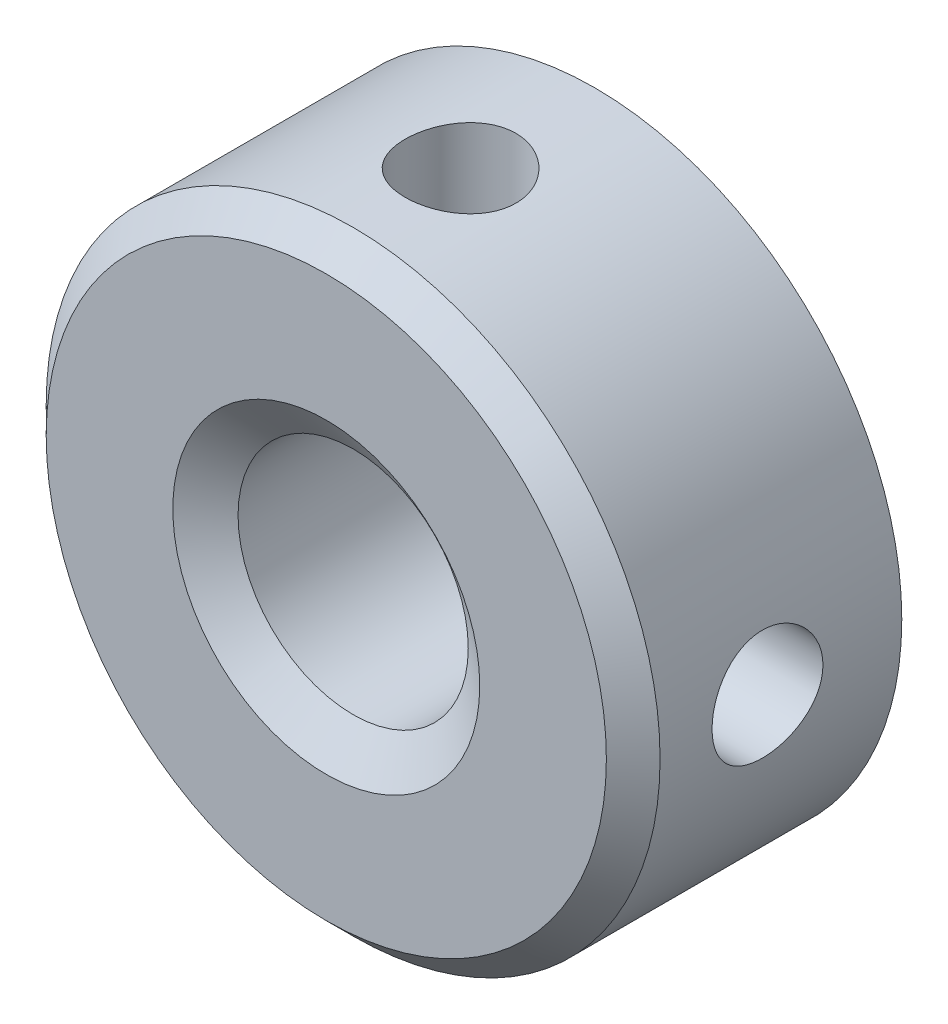
ISO-10303-21;
HEADER;
FILE_DESCRIPTION(('STEP AP214'),'2;1');
FILE_NAME('part.step','',(''),(''),'','','');
FILE_SCHEMA(('AUTOMOTIVE_DESIGN { 1 0 10303 214 1 1 1 1 }'));
ENDSEC;
DATA;
#1=APPLICATION_CONTEXT('core data for automotive mechanical design processes');
#2=APPLICATION_PROTOCOL_DEFINITION('international standard','automotive_design',2000,#1);
#3=PRODUCT_CONTEXT('',#1,'mechanical');
#4=PRODUCT('Part','Part','',(#3));
#5=PRODUCT_RELATED_PRODUCT_CATEGORY('part','',(#4));
#6=PRODUCT_DEFINITION_FORMATION('','',#4);
#7=PRODUCT_DEFINITION_CONTEXT('part definition',#1,'design');
#8=PRODUCT_DEFINITION('design','',#6,#7);
#9=PRODUCT_DEFINITION_SHAPE('','',#8);
#10=(LENGTH_UNIT() NAMED_UNIT(*) SI_UNIT(.MILLI.,.METRE.));
#11=(NAMED_UNIT(*) PLANE_ANGLE_UNIT() SI_UNIT($,.RADIAN.));
#12=(NAMED_UNIT(*) SI_UNIT($,.STERADIAN.) SOLID_ANGLE_UNIT());
#13=UNCERTAINTY_MEASURE_WITH_UNIT(LENGTH_MEASURE(1.E-05),#10,'distance_accuracy_value','');
#14=(GEOMETRIC_REPRESENTATION_CONTEXT(3) GLOBAL_UNCERTAINTY_ASSIGNED_CONTEXT((#13)) GLOBAL_UNIT_ASSIGNED_CONTEXT((#10,
#11,#12)) REPRESENTATION_CONTEXT('',''));
#15=CARTESIAN_POINT('',(0.,0.,0.));
#16=DIRECTION('',(0.,0.,1.));
#17=DIRECTION('',(1.,0.,0.));
#18=AXIS2_PLACEMENT_3D('',#15,#16,#17);
#19=CARTESIAN_POINT('',(0.,0.,-3.5));
#20=DIRECTION('',(0.,0.,1.));
#21=DIRECTION('',(1.,0.,0.));
#22=AXIS2_PLACEMENT_3D('',#19,#20,#21);
#23=CYLINDRICAL_SURFACE('',#22,4.);
#24=CARTESIAN_POINT('',(0.,-4.,-1.0275));
#25=CARTESIAN_POINT('',(0.0402324055650416,-3.99999928207121,-1.02750156488479));
#26=CARTESIAN_POINT('',(0.0804854857145578,-3.99938672130152,-1.03087186677428));
#27=CARTESIAN_POINT('',(0.159859162671895,-3.99700211722237,-1.04425640081981));
#28=CARTESIAN_POINT('',(0.19897874343806,-3.99522906532468,-1.05427641237524));
#29=CARTESIAN_POINT('',(0.27492586707515,-3.99072200016209,-1.08064504702147));
#30=CARTESIAN_POINT('',(0.311755380953226,-3.98798882711238,-1.09698813796246));
#31=CARTESIAN_POINT('',(0.382145759809329,-3.9818606825439,-1.1355237134609));
#32=CARTESIAN_POINT('',(0.415706926094003,-3.97846577211701,-1.15771565811625));
#33=CARTESIAN_POINT('',(0.47898600302115,-3.97134709947296,-1.20758186073378));
#34=CARTESIAN_POINT('',(0.508662190652253,-3.96762039202556,-1.23530864933891));
#35=CARTESIAN_POINT('',(0.562968147654841,-3.96028023924715,-1.29534444782425));
#36=CARTESIAN_POINT('',(0.587597570135685,-3.95666680171624,-1.32765377242808));
#37=CARTESIAN_POINT('',(0.631282247393574,-3.94993373469824,-1.39622956474506));
#38=CARTESIAN_POINT('',(0.650295461943718,-3.94681790591371,-1.43252321915994));
#39=CARTESIAN_POINT('',(0.681938983056788,-3.94147413899126,-1.50785513757615));
#40=CARTESIAN_POINT('',(0.694569798778226,-3.93924613003013,-1.54689318235948));
#41=CARTESIAN_POINT('',(0.712956902250887,-3.93595980867137,-1.62616067510412));
#42=CARTESIAN_POINT('',(0.718785710518137,-3.93488916609034,-1.66637277984826));
#43=CARTESIAN_POINT('',(0.723628356024185,-3.93400158582586,-1.7472173787824));
#44=CARTESIAN_POINT('',(0.722642759986563,-3.93418454388604,-1.78784983773279));
#45=CARTESIAN_POINT('',(0.713943469606807,-3.93577225569209,-1.8678589979259));
#46=CARTESIAN_POINT('',(0.706311894985369,-3.93716209623533,-1.90724496736938));
#47=CARTESIAN_POINT('',(0.684666451097885,-3.94098357666604,-1.9841681657055));
#48=CARTESIAN_POINT('',(0.670652328407126,-3.94341525792047,-2.02170532112377));
#49=CARTESIAN_POINT('',(0.636558283861672,-3.94906219895749,-2.09410752900945));
#50=CARTESIAN_POINT('',(0.616444881836429,-3.95228176427296,-2.12895646608407));
#51=CARTESIAN_POINT('',(0.570746933286653,-3.95913881579743,-2.19481570761747));
#52=CARTESIAN_POINT('',(0.545161870270259,-3.96277634144435,-2.22582564926161));
#53=CARTESIAN_POINT('',(0.488802508987584,-3.97012462715362,-2.28360141563335));
#54=CARTESIAN_POINT('',(0.457957894942576,-3.97383568101403,-2.31029865845852));
#55=CARTESIAN_POINT('',(0.392191146362397,-3.98086397441441,-2.3581497176235));
#56=CARTESIAN_POINT('',(0.357268976336028,-3.98418121052606,-2.37930348570752));
#57=CARTESIAN_POINT('',(0.284269308760035,-3.99005408991156,-2.41547588942557));
#58=CARTESIAN_POINT('',(0.246188387537775,-3.99260889265116,-2.43048776072078));
#59=CARTESIAN_POINT('',(0.167989096769151,-3.99666247663319,-2.45388285857468));
#60=CARTESIAN_POINT('',(0.127870928261586,-3.99816136185897,-2.46226673784658));
#61=CARTESIAN_POINT('',(0.0473263508697057,-3.99992004723597,-2.47207325851328));
#62=CARTESIAN_POINT('',(0.00691174350009734,-4.0001965830578,-2.47358992865411));
#63=CARTESIAN_POINT('',(-0.0735937397235727,-3.99952550657702,-2.46987067399199));
#64=CARTESIAN_POINT('',(-0.113684630210687,-3.99857794992261,-2.46463505615339));
#65=CARTESIAN_POINT('',(-0.192109072794261,-3.99557555589605,-2.44763803762266));
#66=CARTESIAN_POINT('',(-0.230453194126716,-3.99352873504343,-2.43592386440099));
#67=CARTESIAN_POINT('',(-0.304633286138314,-3.98855635966055,-2.40635310354291));
#68=CARTESIAN_POINT('',(-0.340469096087984,-3.98563074888197,-2.38849612271589));
#69=CARTESIAN_POINT('',(-0.409019064929369,-3.97918360232313,-2.34693605402778));
#70=CARTESIAN_POINT('',(-0.441697568686679,-3.97565628053125,-2.32317507147534));
#71=CARTESIAN_POINT('',(-0.502637121291057,-3.96841270168175,-2.27056026824363));
#72=CARTESIAN_POINT('',(-0.530897788908464,-3.96469642835552,-2.24170600850561));
#73=CARTESIAN_POINT('',(-0.582553768946835,-3.95743874926351,-2.1792993480324));
#74=CARTESIAN_POINT('',(-0.605885124668485,-3.95390004881302,-2.14569364228149));
#75=CARTESIAN_POINT('',(-0.646571553083887,-3.94745124522646,-2.07498469815049));
#76=CARTESIAN_POINT('',(-0.66392683756291,-3.94454111981576,-2.03788158377403));
#77=CARTESIAN_POINT('',(-0.69207607502021,-3.93969987677514,-1.96139903738241));
#78=CARTESIAN_POINT('',(-0.702900202744308,-3.93776426376046,-1.92203100881771));
#79=CARTESIAN_POINT('',(-0.717773626282637,-3.9350805763172,-1.84199715558159));
#80=CARTESIAN_POINT('',(-0.721823625489806,-3.93433237859352,-1.80133146609995));
#81=CARTESIAN_POINT('',(-0.723011621106424,-3.93411417186203,-1.72049656217886));
#82=CARTESIAN_POINT('',(-0.720250422703558,-3.93462552149006,-1.68032884461655));
#83=CARTESIAN_POINT('',(-0.708114167671675,-3.93682762266059,-1.60103996601868));
#84=CARTESIAN_POINT('',(-0.698739143983392,-3.93851836832901,-1.56191879977167));
#85=CARTESIAN_POINT('',(-0.673682577896795,-3.94288116614926,-1.48588254841445));
#86=CARTESIAN_POINT('',(-0.658011189155687,-3.94555163777399,-1.44896402084413));
#87=CARTESIAN_POINT('',(-0.620817521589325,-3.9515742400628,-1.37826400544472));
#88=CARTESIAN_POINT('',(-0.599294870915518,-3.95492641404576,-1.34448271717077));
#89=CARTESIAN_POINT('',(-0.550655967041241,-3.96199300823466,-1.28050963824912));
#90=CARTESIAN_POINT('',(-0.523466068712371,-3.96571181881409,-1.25037431605228));
#91=CARTESIAN_POINT('',(-0.464418731346957,-3.97305909493448,-1.19506007581957));
#92=CARTESIAN_POINT('',(-0.432560220563081,-3.97668753950624,-1.16988229897852));
#93=CARTESIAN_POINT('',(-0.364765210846601,-3.98348031155494,-1.12500472965806));
#94=CARTESIAN_POINT('',(-0.328797180021505,-3.98664055471551,-1.1053519385649));
#95=CARTESIAN_POINT('',(-0.254025487566143,-3.992101059684,-1.07239893856745));
#96=CARTESIAN_POINT('',(-0.215224586226555,-3.99440214561284,-1.0590926385635));
#97=CARTESIAN_POINT('',(-0.146913775912392,-3.99740453445352,-1.04197641876778));
#98=CARTESIAN_POINT('',(-0.117808246455036,-3.99837243932543,-1.03655683634259));
#99=CARTESIAN_POINT('',(-0.0591388618449127,-3.99967042883236,-1.02931809210109));
#100=CARTESIAN_POINT('',(-0.0295750169721853,-4.00000052775259,-1.02749884964636));
#101=CARTESIAN_POINT('',(0.,-4.,-1.0275));
#102=B_SPLINE_CURVE_WITH_KNOTS('',3,(#24,#25,#26,#27,#28,#29,#30,#31,#32,#33,#34,#35,#36,#37,
#38,#39,#40,#41,#42,#43,#44,#45,#46,#47,#48,#49,#50,#51,#52,#53,#54,#55,#56,#57,#58,#59,#60,#61,
#62,#63,#64,#65,#66,#67,#68,#69,#70,#71,#72,#73,#74,#75,#76,#77,#78,#79,#80,#81,#82,#83,#84,#85,
#86,#87,#88,#89,#90,#91,#92,#93,#94,#95,#96,#97,#98,#99,#100,#101),.UNSPECIFIED.,.T.,.F.,(4,2,2,
2,2,2,2,2,2,2,2,2,2,2,2,2,2,2,2,2,2,2,2,2,2,2,2,2,2,2,2,2,2,2,2,2,2,2,4),(0.,0.120589077301182,
0.241283098546327,0.361871760845293,0.482449295616093,0.60423085178249,0.726020775828199,
0.848700511370488,0.971370458540291,1.09272023628634,1.21405992203462,1.33392123633206,
1.45378731024392,1.57432364379394,1.69487136027419,1.81717925404505,1.93948821246774,
2.06193151480696,2.1843627576384,2.30511244801172,2.42585664920233,2.54573203321307,
2.66561509167033,2.78672363080564,2.90784261503429,3.0304478177818,3.15304867509096,
3.27507867560439,3.39709600432244,3.51731835068335,3.6375400982706,3.75756874681702,
3.87760502498541,3.99931106772016,4.12104509372834,4.24378537426311,4.36640761551682,
4.45505515819371,4.54370071536978),.UNSPECIFIED.);
#103=CARTESIAN_POINT('',(0.,-4.,-1.0275));
#104=VERTEX_POINT('',#103);
#105=EDGE_CURVE('E45',#104,#104,#102,.T.);
#106=ORIENTED_EDGE('',*,*,#105,.T.);
#107=EDGE_LOOP('',(#106));
#108=FACE_BOUND('',#107,.T.);
#109=CARTESIAN_POINT('',(0.,4.,-1.0275));
#110=CARTESIAN_POINT('',(-0.0402324055650226,3.99999928207121,-1.02750156488479));
#111=CARTESIAN_POINT('',(-0.0804854857145388,3.99938672130152,-1.03087186677428));
#112=CARTESIAN_POINT('',(-0.159859162671876,3.99700211722237,-1.04425640081981));
#113=CARTESIAN_POINT('',(-0.198978743438041,3.99522906532468,-1.05427641237524));
#114=CARTESIAN_POINT('',(-0.274925867075131,3.99072200016209,-1.08064504702147));
#115=CARTESIAN_POINT('',(-0.311755380953207,3.98798882711238,-1.09698813796246));
#116=CARTESIAN_POINT('',(-0.38214575980931,3.9818606825439,-1.1355237134609));
#117=CARTESIAN_POINT('',(-0.415706926093984,3.97846577211701,-1.15771565811625));
#118=CARTESIAN_POINT('',(-0.478986003021131,3.97134709947296,-1.20758186073378));
#119=CARTESIAN_POINT('',(-0.508662190652234,3.96762039202556,-1.23530864933891));
#120=CARTESIAN_POINT('',(-0.562968147654822,3.96028023924716,-1.29534444782425));
#121=CARTESIAN_POINT('',(-0.587597570135666,3.95666680171624,-1.32765377242808));
#122=CARTESIAN_POINT('',(-0.631282247393555,3.94993373469824,-1.39622956474506));
#123=CARTESIAN_POINT('',(-0.650295461943699,3.94681790591372,-1.43252321915994));
#124=CARTESIAN_POINT('',(-0.681938983056769,3.94147413899126,-1.50785513757615));
#125=CARTESIAN_POINT('',(-0.694569798778208,3.93924613003014,-1.54689318235948));
#126=CARTESIAN_POINT('',(-0.712956902250869,3.93595980867138,-1.62616067510412));
#127=CARTESIAN_POINT('',(-0.718785710518118,3.93488916609034,-1.66637277984826));
#128=CARTESIAN_POINT('',(-0.723628356024166,3.93400158582587,-1.7472173787824));
#129=CARTESIAN_POINT('',(-0.722642759986545,3.93418454388605,-1.78784983773279));
#130=CARTESIAN_POINT('',(-0.713943469606788,3.93577225569209,-1.8678589979259));
#131=CARTESIAN_POINT('',(-0.70631189498535,3.93716209623534,-1.90724496736938));
#132=CARTESIAN_POINT('',(-0.684666451097866,3.94098357666604,-1.9841681657055));
#133=CARTESIAN_POINT('',(-0.670652328407107,3.94341525792047,-2.02170532112377));
#134=CARTESIAN_POINT('',(-0.636558283861653,3.94906219895749,-2.09410752900945));
#135=CARTESIAN_POINT('',(-0.61644488183641,3.95228176427296,-2.12895646608407));
#136=CARTESIAN_POINT('',(-0.570746933286634,3.95913881579743,-2.19481570761748));
#137=CARTESIAN_POINT('',(-0.54516187027024,3.96277634144435,-2.22582564926161));
#138=CARTESIAN_POINT('',(-0.488802508987565,3.97012462715362,-2.28360141563335));
#139=CARTESIAN_POINT('',(-0.457957894942557,3.97383568101403,-2.31029865845852));
#140=CARTESIAN_POINT('',(-0.392191146362378,3.98086397441441,-2.3581497176235));
#141=CARTESIAN_POINT('',(-0.357268976336009,3.98418121052607,-2.37930348570752));
#142=CARTESIAN_POINT('',(-0.284269308760015,3.99005408991156,-2.41547588942557));
#143=CARTESIAN_POINT('',(-0.246188387537755,3.99260889265116,-2.43048776072078));
#144=CARTESIAN_POINT('',(-0.167989096769131,3.9966624766332,-2.45388285857468));
#145=CARTESIAN_POINT('',(-0.127870928261567,3.99816136185897,-2.46226673784658));
#146=CARTESIAN_POINT('',(-0.0473263508696865,3.99992004723597,-2.47207325851328));
#147=CARTESIAN_POINT('',(-0.0069117435000781,4.0001965830578,-2.47358992865411));
#148=CARTESIAN_POINT('',(0.073593739723592,3.99952550657702,-2.46987067399199));
#149=CARTESIAN_POINT('',(0.113684630210707,3.99857794992261,-2.46463505615339));
#150=CARTESIAN_POINT('',(0.19210907279428,3.99557555589605,-2.44763803762266));
#151=CARTESIAN_POINT('',(0.230453194126735,3.99352873504343,-2.43592386440099));
#152=CARTESIAN_POINT('',(0.304633286138333,3.98855635966055,-2.40635310354291));
#153=CARTESIAN_POINT('',(0.340469096088003,3.98563074888197,-2.38849612271589));
#154=CARTESIAN_POINT('',(0.409019064929388,3.97918360232313,-2.34693605402778));
#155=CARTESIAN_POINT('',(0.441697568686698,3.97565628053125,-2.32317507147534));
#156=CARTESIAN_POINT('',(0.502637121291076,3.96841270168175,-2.27056026824363));
#157=CARTESIAN_POINT('',(0.530897788908483,3.96469642835551,-2.24170600850561));
#158=CARTESIAN_POINT('',(0.582553768946854,3.95743874926351,-2.1792993480324));
#159=CARTESIAN_POINT('',(0.605885124668504,3.95390004881302,-2.14569364228149));
#160=CARTESIAN_POINT('',(0.646571553083906,3.94745124522646,-2.07498469815049));
#161=CARTESIAN_POINT('',(0.663926837562929,3.94454111981575,-2.03788158377403));
#162=CARTESIAN_POINT('',(0.692076075020228,3.93969987677514,-1.96139903738241));
#163=CARTESIAN_POINT('',(0.702900202744327,3.93776426376046,-1.92203100881771));
#164=CARTESIAN_POINT('',(0.717773626282656,3.93508057631719,-1.84199715558159));
#165=CARTESIAN_POINT('',(0.721823625489825,3.93433237859352,-1.80133146609995));
#166=CARTESIAN_POINT('',(0.723011621106443,3.93411417186202,-1.72049656217886));
#167=CARTESIAN_POINT('',(0.720250422703577,3.93462552149006,-1.68032884461655));
#168=CARTESIAN_POINT('',(0.708114167671694,3.93682762266059,-1.60103996601868));
#169=CARTESIAN_POINT('',(0.698739143983411,3.938518368329,-1.56191879977167));
#170=CARTESIAN_POINT('',(0.673682577896814,3.94288116614926,-1.48588254841445));
#171=CARTESIAN_POINT('',(0.658011189155706,3.94555163777398,-1.44896402084413));
#172=CARTESIAN_POINT('',(0.620817521589343,3.9515742400628,-1.37826400544472));
#173=CARTESIAN_POINT('',(0.599294870915536,3.95492641404576,-1.34448271717077));
#174=CARTESIAN_POINT('',(0.55065596704126,3.96199300823466,-1.28050963824912));
#175=CARTESIAN_POINT('',(0.52346606871239,3.96571181881409,-1.25037431605228));
#176=CARTESIAN_POINT('',(0.464418731346975,3.97305909493447,-1.19506007581957));
#177=CARTESIAN_POINT('',(0.4325602205631,3.97668753950624,-1.16988229897852));
#178=CARTESIAN_POINT('',(0.364765210846619,3.98348031155494,-1.12500472965806));
#179=CARTESIAN_POINT('',(0.328797180021524,3.98664055471551,-1.1053519385649));
#180=CARTESIAN_POINT('',(0.254025487566162,3.992101059684,-1.07239893856745));
#181=CARTESIAN_POINT('',(0.215224586226574,3.99440214561284,-1.0590926385635));
#182=CARTESIAN_POINT('',(0.146913775912411,3.99740453445352,-1.04197641876778));
#183=CARTESIAN_POINT('',(0.117808246455056,3.99837243932543,-1.03655683634259));
#184=CARTESIAN_POINT('',(0.0591388618449323,3.99967042883236,-1.02931809210109));
#185=CARTESIAN_POINT('',(0.0295750169722046,4.00000052775259,-1.02749884964636));
#186=CARTESIAN_POINT('',(0.,4.,-1.0275));
#187=B_SPLINE_CURVE_WITH_KNOTS('',3,(#109,#110,#111,#112,#113,#114,#115,#116,#117,#118,#119,
#120,#121,#122,#123,#124,#125,#126,#127,#128,#129,#130,#131,#132,#133,#134,#135,#136,#137,#138,
#139,#140,#141,#142,#143,#144,#145,#146,#147,#148,#149,#150,#151,#152,#153,#154,#155,#156,#157,
#158,#159,#160,#161,#162,#163,#164,#165,#166,#167,#168,#169,#170,#171,#172,#173,#174,#175,#176,
#177,#178,#179,#180,#181,#182,#183,#184,#185,#186),.UNSPECIFIED.,.T.,.F.,(4,2,2,2,2,2,2,2,2,2,2,
2,2,2,2,2,2,2,2,2,2,2,2,2,2,2,2,2,2,2,2,2,2,2,2,2,2,2,4),(0.,0.120589077301182,
0.241283098546327,0.361871760845293,0.482449295616093,0.60423085178249,0.726020775828199,
0.848700511370488,0.971370458540291,1.09272023628634,1.21405992203462,1.33392123633206,
1.45378731024392,1.57432364379394,1.69487136027419,1.81717925404505,1.93948821246774,
2.06193151480696,2.1843627576384,2.30511244801172,2.42585664920233,2.54573203321307,
2.66561509167033,2.78672363080564,2.90784261503429,3.0304478177818,3.15304867509096,
3.27507867560439,3.39709600432244,3.51731835068335,3.6375400982706,3.75756874681702,
3.87760502498541,3.99931106772016,4.12104509372834,4.24378537426311,4.36640761551682,
4.45505515819371,4.54370071536978),.UNSPECIFIED.);
#188=CARTESIAN_POINT('',(0.,4.,-1.0275));
#189=VERTEX_POINT('',#188);
#190=EDGE_CURVE('E91',#189,#189,#187,.T.);
#191=ORIENTED_EDGE('',*,*,#190,.T.);
#192=EDGE_LOOP('',(#191));
#193=FACE_BOUND('',#192,.T.);
#194=CARTESIAN_POINT('',(0.,0.,-0.350000000000001));
#195=DIRECTION('',(0.,0.,1.));
#196=DIRECTION('',(1.,0.,0.));
#197=AXIS2_PLACEMENT_3D('',#194,#195,#196);
#198=CIRCLE('',#197,4.);
#199=CARTESIAN_POINT('',(4.,0.,-0.350000000000001));
#200=VERTEX_POINT('',#199);
#201=EDGE_CURVE('E165',#200,#200,#198,.F.);
#202=ORIENTED_EDGE('',*,*,#201,.T.);
#203=EDGE_LOOP('',(#202));
#204=FACE_BOUND('',#203,.T.);
#205=CARTESIAN_POINT('',(0.,0.,-3.5));
#206=DIRECTION('',(0.,0.,1.));
#207=DIRECTION('',(1.,0.,0.));
#208=AXIS2_PLACEMENT_3D('',#205,#206,#207);
#209=CIRCLE('',#208,4.);
#210=CARTESIAN_POINT('',(4.,0.,-3.5));
#211=VERTEX_POINT('',#210);
#212=EDGE_CURVE('E145',#211,#211,#209,.T.);
#213=ORIENTED_EDGE('',*,*,#212,.T.);
#214=EDGE_LOOP('',(#213));
#215=FACE_BOUND('',#214,.T.);
#216=CARTESIAN_POINT('',(-4.,0.,-1.0275));
#217=CARTESIAN_POINT('',(-3.99999928207121,-0.0402324055650321,-1.02750156488479));
#218=CARTESIAN_POINT('',(-3.99938672130152,-0.0804854857145483,-1.03087186677428));
#219=CARTESIAN_POINT('',(-3.99700211722237,-0.159859162671885,-1.04425640081981));
#220=CARTESIAN_POINT('',(-3.99522906532468,-0.198978743438051,-1.05427641237524));
#221=CARTESIAN_POINT('',(-3.99072200016209,-0.27492586707514,-1.08064504702147));
#222=CARTESIAN_POINT('',(-3.98798882711238,-0.311755380953217,-1.09698813796246));
#223=CARTESIAN_POINT('',(-3.9818606825439,-0.382145759809319,-1.1355237134609));
#224=CARTESIAN_POINT('',(-3.97846577211701,-0.415706926093993,-1.15771565811625));
#225=CARTESIAN_POINT('',(-3.97134709947296,-0.47898600302114,-1.20758186073378));
#226=CARTESIAN_POINT('',(-3.96762039202556,-0.508662190652244,-1.23530864933891));
#227=CARTESIAN_POINT('',(-3.96028023924716,-0.562968147654831,-1.29534444782425));
#228=CARTESIAN_POINT('',(-3.95666680171624,-0.587597570135675,-1.32765377242808));
#229=CARTESIAN_POINT('',(-3.94993373469824,-0.631282247393565,-1.39622956474506));
#230=CARTESIAN_POINT('',(-3.94681790591372,-0.650295461943708,-1.43252321915994));
#231=CARTESIAN_POINT('',(-3.94147413899126,-0.681938983056778,-1.50785513757615));
#232=CARTESIAN_POINT('',(-3.93924613003014,-0.694569798778217,-1.54689318235948));
#233=CARTESIAN_POINT('',(-3.93595980867138,-0.712956902250878,-1.62616067510412));
#234=CARTESIAN_POINT('',(-3.93488916609034,-0.718785710518127,-1.66637277984826));
#235=CARTESIAN_POINT('',(-3.93400158582587,-0.723628356024176,-1.7472173787824));
#236=CARTESIAN_POINT('',(-3.93418454388605,-0.722642759986554,-1.78784983773279));
#237=CARTESIAN_POINT('',(-3.93577225569209,-0.713943469606798,-1.8678589979259));
#238=CARTESIAN_POINT('',(-3.93716209623534,-0.70631189498536,-1.90724496736938));
#239=CARTESIAN_POINT('',(-3.94098357666604,-0.684666451097876,-1.9841681657055));
#240=CARTESIAN_POINT('',(-3.94341525792047,-0.670652328407117,-2.02170532112377));
#241=CARTESIAN_POINT('',(-3.94906219895749,-0.636558283861663,-2.09410752900945));
#242=CARTESIAN_POINT('',(-3.95228176427296,-0.61644488183642,-2.12895646608407));
#243=CARTESIAN_POINT('',(-3.95913881579743,-0.570746933286644,-2.19481570761748));
#244=CARTESIAN_POINT('',(-3.96277634144435,-0.54516187027025,-2.22582564926161));
#245=CARTESIAN_POINT('',(-3.97012462715362,-0.488802508987574,-2.28360141563335));
#246=CARTESIAN_POINT('',(-3.97383568101403,-0.457957894942566,-2.31029865845852));
#247=CARTESIAN_POINT('',(-3.98086397441441,-0.392191146362388,-2.3581497176235));
#248=CARTESIAN_POINT('',(-3.98418121052607,-0.357268976336019,-2.37930348570752));
#249=CARTESIAN_POINT('',(-3.99005408991156,-0.284269308760025,-2.41547588942557));
#250=CARTESIAN_POINT('',(-3.99260889265116,-0.246188387537765,-2.43048776072078));
#251=CARTESIAN_POINT('',(-3.99666247663319,-0.167989096769141,-2.45388285857468));
#252=CARTESIAN_POINT('',(-3.99816136185897,-0.127870928261576,-2.46226673784658));
#253=CARTESIAN_POINT('',(-3.99992004723597,-0.0473263508696964,-2.47207325851328));
#254=CARTESIAN_POINT('',(-4.0001965830578,-0.00691174350008796,-2.47358992865411));
#255=CARTESIAN_POINT('',(-3.99952550657702,0.0735937397235821,-2.46987067399199));
#256=CARTESIAN_POINT('',(-3.99857794992261,0.113684630210697,-2.46463505615339));
#257=CARTESIAN_POINT('',(-3.99557555589605,0.19210907279427,-2.44763803762266));
#258=CARTESIAN_POINT('',(-3.99352873504343,0.230453194126725,-2.43592386440099));
#259=CARTESIAN_POINT('',(-3.98855635966055,0.304633286138323,-2.40635310354291));
#260=CARTESIAN_POINT('',(-3.98563074888197,0.340469096087993,-2.38849612271589));
#261=CARTESIAN_POINT('',(-3.97918360232313,0.409019064929378,-2.34693605402778));
#262=CARTESIAN_POINT('',(-3.97565628053125,0.441697568686689,-2.32317507147534));
#263=CARTESIAN_POINT('',(-3.96841270168175,0.502637121291066,-2.27056026824363));
#264=CARTESIAN_POINT('',(-3.96469642835551,0.530897788908474,-2.24170600850561));
#265=CARTESIAN_POINT('',(-3.95743874926351,0.582553768946844,-2.1792993480324));
#266=CARTESIAN_POINT('',(-3.95390004881302,0.605885124668494,-2.14569364228149));
#267=CARTESIAN_POINT('',(-3.94745124522646,0.646571553083896,-2.07498469815049));
#268=CARTESIAN_POINT('',(-3.94454111981575,0.663926837562919,-2.03788158377403));
#269=CARTESIAN_POINT('',(-3.93969987677514,0.692076075020219,-1.96139903738241));
#270=CARTESIAN_POINT('',(-3.93776426376046,0.702900202744317,-1.92203100881771));
#271=CARTESIAN_POINT('',(-3.93508057631719,0.717773626282646,-1.84199715558159));
#272=CARTESIAN_POINT('',(-3.93433237859352,0.721823625489815,-1.80133146609995));
#273=CARTESIAN_POINT('',(-3.93411417186202,0.723011621106434,-1.72049656217886));
#274=CARTESIAN_POINT('',(-3.93462552149006,0.720250422703567,-1.68032884461655));
#275=CARTESIAN_POINT('',(-3.93682762266059,0.708114167671684,-1.60103996601868));
#276=CARTESIAN_POINT('',(-3.938518368329,0.698739143983402,-1.56191879977167));
#277=CARTESIAN_POINT('',(-3.94288116614926,0.673682577896805,-1.48588254841445));
#278=CARTESIAN_POINT('',(-3.94555163777399,0.658011189155697,-1.44896402084413));
#279=CARTESIAN_POINT('',(-3.9515742400628,0.620817521589334,-1.37826400544472));
#280=CARTESIAN_POINT('',(-3.95492641404576,0.599294870915527,-1.34448271717077));
#281=CARTESIAN_POINT('',(-3.96199300823466,0.550655967041251,-1.28050963824912));
#282=CARTESIAN_POINT('',(-3.96571181881409,0.523466068712381,-1.25037431605228));
#283=CARTESIAN_POINT('',(-3.97305909493448,0.464418731346966,-1.19506007581957));
#284=CARTESIAN_POINT('',(-3.97668753950624,0.432560220563091,-1.16988229897852));
#285=CARTESIAN_POINT('',(-3.98348031155494,0.36476521084661,-1.12500472965806));
#286=CARTESIAN_POINT('',(-3.98664055471551,0.328797180021515,-1.1053519385649));
#287=CARTESIAN_POINT('',(-3.992101059684,0.254025487566153,-1.07239893856745));
#288=CARTESIAN_POINT('',(-3.99440214561284,0.215224586226565,-1.0590926385635));
#289=CARTESIAN_POINT('',(-3.99740453445352,0.146913775912402,-1.04197641876778));
#290=CARTESIAN_POINT('',(-3.99837243932543,0.117808246455047,-1.03655683634259));
#291=CARTESIAN_POINT('',(-3.99967042883236,0.0591388618449229,-1.02931809210109));
#292=CARTESIAN_POINT('',(-4.00000052775259,0.0295750169721951,-1.02749884964636));
#293=CARTESIAN_POINT('',(-4.,0.,-1.0275));
#294=B_SPLINE_CURVE_WITH_KNOTS('',3,(#216,#217,#218,#219,#220,#221,#222,#223,#224,#225,#226,
#227,#228,#229,#230,#231,#232,#233,#234,#235,#236,#237,#238,#239,#240,#241,#242,#243,#244,#245,
#246,#247,#248,#249,#250,#251,#252,#253,#254,#255,#256,#257,#258,#259,#260,#261,#262,#263,#264,
#265,#266,#267,#268,#269,#270,#271,#272,#273,#274,#275,#276,#277,#278,#279,#280,#281,#282,#283,
#284,#285,#286,#287,#288,#289,#290,#291,#292,#293),.UNSPECIFIED.,.T.,.F.,(4,2,2,2,2,2,2,2,2,2,2,
2,2,2,2,2,2,2,2,2,2,2,2,2,2,2,2,2,2,2,2,2,2,2,2,2,2,2,4),(0.,0.120589077301182,
0.241283098546327,0.361871760845293,0.482449295616093,0.604230851782489,0.726020775828198,
0.848700511370487,0.971370458540291,1.09272023628634,1.21405992203462,1.33392123633206,
1.45378731024392,1.57432364379394,1.69487136027419,1.81717925404505,1.93948821246774,
2.06193151480696,2.1843627576384,2.30511244801172,2.42585664920233,2.54573203321307,
2.66561509167033,2.78672363080564,2.90784261503429,3.0304478177818,3.15304867509096,
3.27507867560439,3.39709600432244,3.51731835068335,3.6375400982706,3.75756874681702,
3.87760502498541,3.99931106772016,4.12104509372834,4.24378537426311,4.36640761551682,
4.45505515819371,4.54370071536978),.UNSPECIFIED.);
#295=CARTESIAN_POINT('',(-4.,0.,-1.0275));
#296=VERTEX_POINT('',#295);
#297=EDGE_CURVE('E98',#296,#296,#294,.T.);
#298=ORIENTED_EDGE('',*,*,#297,.T.);
#299=EDGE_LOOP('',(#298));
#300=FACE_BOUND('',#299,.T.);
#301=CARTESIAN_POINT('',(4.,0.,-1.0275));
#302=CARTESIAN_POINT('',(3.99999928207121,0.0402324055650503,-1.02750156488479));
#303=CARTESIAN_POINT('',(3.99938672130152,0.0804854857145664,-1.03087186677428));
#304=CARTESIAN_POINT('',(3.99700211722237,0.159859162671903,-1.04425640081981));
#305=CARTESIAN_POINT('',(3.99522906532468,0.198978743438069,-1.05427641237524));
#306=CARTESIAN_POINT('',(3.99072200016209,0.274925867075158,-1.08064504702147));
#307=CARTESIAN_POINT('',(3.98798882711238,0.311755380953235,-1.09698813796246));
#308=CARTESIAN_POINT('',(3.9818606825439,0.382145759809337,-1.1355237134609));
#309=CARTESIAN_POINT('',(3.97846577211701,0.415706926094011,-1.15771565811625));
#310=CARTESIAN_POINT('',(3.97134709947296,0.478986003021158,-1.20758186073378));
#311=CARTESIAN_POINT('',(3.96762039202556,0.508662190652262,-1.23530864933891));
#312=CARTESIAN_POINT('',(3.96028023924715,0.562968147654849,-1.29534444782425));
#313=CARTESIAN_POINT('',(3.95666680171624,0.587597570135693,-1.32765377242808));
#314=CARTESIAN_POINT('',(3.94993373469824,0.631282247393583,-1.39622956474506));
#315=CARTESIAN_POINT('',(3.94681790591371,0.650295461943726,-1.43252321915994));
#316=CARTESIAN_POINT('',(3.94147413899126,0.681938983056796,-1.50785513757615));
#317=CARTESIAN_POINT('',(3.93924613003013,0.694569798778235,-1.54689318235948));
#318=CARTESIAN_POINT('',(3.93595980867137,0.712956902250896,-1.62616067510412));
#319=CARTESIAN_POINT('',(3.93488916609034,0.718785710518145,-1.66637277984826));
#320=CARTESIAN_POINT('',(3.93400158582586,0.723628356024194,-1.7472173787824));
#321=CARTESIAN_POINT('',(3.93418454388604,0.722642759986572,-1.78784983773279));
#322=CARTESIAN_POINT('',(3.93577225569208,0.713943469606816,-1.8678589979259));
#323=CARTESIAN_POINT('',(3.93716209623533,0.706311894985377,-1.90724496736938));
#324=CARTESIAN_POINT('',(3.94098357666604,0.684666451097893,-1.9841681657055));
#325=CARTESIAN_POINT('',(3.94341525792047,0.670652328407135,-2.02170532112377));
#326=CARTESIAN_POINT('',(3.94906219895749,0.63655828386168,-2.09410752900945));
#327=CARTESIAN_POINT('',(3.95228176427296,0.616444881836438,-2.12895646608407));
#328=CARTESIAN_POINT('',(3.95913881579743,0.570746933286661,-2.19481570761748));
#329=CARTESIAN_POINT('',(3.96277634144435,0.545161870270268,-2.22582564926161));
#330=CARTESIAN_POINT('',(3.97012462715361,0.488802508987592,-2.28360141563335));
#331=CARTESIAN_POINT('',(3.97383568101403,0.457957894942584,-2.31029865845852));
#332=CARTESIAN_POINT('',(3.98086397441441,0.392191146362406,-2.3581497176235));
#333=CARTESIAN_POINT('',(3.98418121052606,0.357268976336036,-2.37930348570752));
#334=CARTESIAN_POINT('',(3.99005408991156,0.284269308760043,-2.41547588942557));
#335=CARTESIAN_POINT('',(3.99260889265116,0.246188387537783,-2.43048776072078));
#336=CARTESIAN_POINT('',(3.99666247663319,0.167989096769159,-2.45388285857468));
#337=CARTESIAN_POINT('',(3.99816136185897,0.127870928261594,-2.46226673784658));
#338=CARTESIAN_POINT('',(3.99992004723597,0.0473263508697142,-2.47207325851328));
#339=CARTESIAN_POINT('',(4.0001965830578,0.00691174350010583,-2.47358992865411));
#340=CARTESIAN_POINT('',(3.99952550657702,-0.0735937397235642,-2.46987067399199));
#341=CARTESIAN_POINT('',(3.99857794992261,-0.113684630210679,-2.46463505615339));
#342=CARTESIAN_POINT('',(3.99557555589605,-0.192109072794252,-2.44763803762266));
#343=CARTESIAN_POINT('',(3.99352873504343,-0.230453194126707,-2.43592386440099));
#344=CARTESIAN_POINT('',(3.98855635966055,-0.304633286138305,-2.40635310354291));
#345=CARTESIAN_POINT('',(3.98563074888197,-0.340469096087975,-2.38849612271589));
#346=CARTESIAN_POINT('',(3.97918360232313,-0.40901906492936,-2.34693605402778));
#347=CARTESIAN_POINT('',(3.97565628053125,-0.441697568686671,-2.32317507147534));
#348=CARTESIAN_POINT('',(3.96841270168175,-0.502637121291049,-2.27056026824363));
#349=CARTESIAN_POINT('',(3.96469642835552,-0.530897788908456,-2.24170600850561));
#350=CARTESIAN_POINT('',(3.95743874926351,-0.582553768946826,-2.1792993480324));
#351=CARTESIAN_POINT('',(3.95390004881303,-0.605885124668476,-2.14569364228149));
#352=CARTESIAN_POINT('',(3.94745124522647,-0.646571553083878,-2.07498469815049));
#353=CARTESIAN_POINT('',(3.94454111981576,-0.663926837562901,-2.03788158377403));
#354=CARTESIAN_POINT('',(3.93969987677514,-0.692076075020201,-1.96139903738241));
#355=CARTESIAN_POINT('',(3.93776426376047,-0.702900202744299,-1.92203100881771));
#356=CARTESIAN_POINT('',(3.9350805763172,-0.717773626282628,-1.84199715558159));
#357=CARTESIAN_POINT('',(3.93433237859352,-0.721823625489797,-1.80133146609995));
#358=CARTESIAN_POINT('',(3.93411417186203,-0.723011621106416,-1.72049656217886));
#359=CARTESIAN_POINT('',(3.93462552149006,-0.720250422703549,-1.68032884461655));
#360=CARTESIAN_POINT('',(3.93682762266059,-0.708114167671666,-1.60103996601868));
#361=CARTESIAN_POINT('',(3.93851836832901,-0.698739143983384,-1.56191879977167));
#362=CARTESIAN_POINT('',(3.94288116614926,-0.673682577896787,-1.48588254841445));
#363=CARTESIAN_POINT('',(3.94555163777399,-0.658011189155679,-1.44896402084413));
#364=CARTESIAN_POINT('',(3.9515742400628,-0.620817521589316,-1.37826400544472));
#365=CARTESIAN_POINT('',(3.95492641404577,-0.599294870915509,-1.34448271717077));
#366=CARTESIAN_POINT('',(3.96199300823466,-0.550655967041233,-1.28050963824912));
#367=CARTESIAN_POINT('',(3.96571181881409,-0.523466068712362,-1.25037431605228));
#368=CARTESIAN_POINT('',(3.97305909493448,-0.464418731346948,-1.19506007581957));
#369=CARTESIAN_POINT('',(3.97668753950625,-0.432560220563073,-1.16988229897852));
#370=CARTESIAN_POINT('',(3.98348031155494,-0.364765210846592,-1.12500472965806));
#371=CARTESIAN_POINT('',(3.98664055471552,-0.328797180021497,-1.1053519385649));
#372=CARTESIAN_POINT('',(3.992101059684,-0.254025487566134,-1.07239893856745));
#373=CARTESIAN_POINT('',(3.99440214561284,-0.215224586226547,-1.0590926385635));
#374=CARTESIAN_POINT('',(3.99740453445352,-0.146913775912383,-1.04197641876778));
#375=CARTESIAN_POINT('',(3.99837243932544,-0.117808246455028,-1.03655683634259));
#376=CARTESIAN_POINT('',(3.99967042883236,-0.0591388618449046,-1.02931809210109));
#377=CARTESIAN_POINT('',(4.00000052775259,-0.0295750169721769,-1.02749884964636));
#378=CARTESIAN_POINT('',(4.,0.,-1.0275));
#379=B_SPLINE_CURVE_WITH_KNOTS('',3,(#301,#302,#303,#304,#305,#306,#307,#308,#309,#310,#311,
#312,#313,#314,#315,#316,#317,#318,#319,#320,#321,#322,#323,#324,#325,#326,#327,#328,#329,#330,
#331,#332,#333,#334,#335,#336,#337,#338,#339,#340,#341,#342,#343,#344,#345,#346,#347,#348,#349,
#350,#351,#352,#353,#354,#355,#356,#357,#358,#359,#360,#361,#362,#363,#364,#365,#366,#367,#368,
#369,#370,#371,#372,#373,#374,#375,#376,#377,#378),.UNSPECIFIED.,.T.,.F.,(4,2,2,2,2,2,2,2,2,2,2,
2,2,2,2,2,2,2,2,2,2,2,2,2,2,2,2,2,2,2,2,2,2,2,2,2,2,2,4),(0.,0.120589077301182,
0.241283098546327,0.361871760845292,0.482449295616093,0.60423085178249,0.726020775828199,
0.848700511370488,0.971370458540291,1.09272023628634,1.21405992203462,1.33392123633206,
1.45378731024392,1.57432364379394,1.69487136027419,1.81717925404505,1.93948821246774,
2.06193151480696,2.1843627576384,2.30511244801172,2.42585664920233,2.54573203321307,
2.66561509167033,2.78672363080564,2.90784261503429,3.0304478177818,3.15304867509096,
3.27507867560439,3.39709600432244,3.51731835068335,3.6375400982706,3.75756874681702,
3.87760502498541,3.99931106772016,4.12104509372834,4.24378537426311,4.36640761551682,
4.45505515819371,4.54370071536978),.UNSPECIFIED.);
#380=CARTESIAN_POINT('',(4.,0.,-1.0275));
#381=VERTEX_POINT('',#380);
#382=EDGE_CURVE('E11',#381,#381,#379,.T.);
#383=ORIENTED_EDGE('',*,*,#382,.T.);
#384=EDGE_LOOP('',(#383));
#385=FACE_BOUND('',#384,.T.);
#386=ADVANCED_FACE('F34',(#108,#193,#204,#215,#300,#385),#23,.T.);
#387=CARTESIAN_POINT('',(0.,0.,-3.5));
#388=DIRECTION('',(0.,0.,1.));
#389=DIRECTION('',(1.,0.,0.));
#390=AXIS2_PLACEMENT_3D('',#387,#388,#389);
#391=CYLINDRICAL_SURFACE('',#390,1.5);
#392=CARTESIAN_POINT('',(0.,0.,-0.350103769104855));
#393=DIRECTION('',(0.,0.,1.));
#394=DIRECTION('',(1.,0.,0.));
#395=AXIS2_PLACEMENT_3D('',#392,#393,#394);
#396=CIRCLE('',#395,1.5);
#397=CARTESIAN_POINT('',(1.5,0.,-0.350103769104855));
#398=VERTEX_POINT('',#397);
#399=EDGE_CURVE('E160',#398,#398,#396,.F.);
#400=ORIENTED_EDGE('',*,*,#399,.F.);
#401=EDGE_LOOP('',(#400));
#402=FACE_BOUND('',#401,.T.);
#403=CARTESIAN_POINT('',(0.,0.,-3.12449623089514));
#404=DIRECTION('',(0.,0.,-1.));
#405=DIRECTION('',(-1.,0.,0.));
#406=AXIS2_PLACEMENT_3D('',#403,#404,#405);
#407=CIRCLE('',#406,1.5);
#408=CARTESIAN_POINT('',(-1.5,0.,-3.12449623089514));
#409=VERTEX_POINT('',#408);
#410=EDGE_CURVE('E150',#409,#409,#407,.F.);
#411=ORIENTED_EDGE('',*,*,#410,.F.);
#412=EDGE_LOOP('',(#411));
#413=FACE_BOUND('',#412,.T.);
#414=ADVANCED_FACE('F74',(#402,#413),#391,.F.);
#415=CARTESIAN_POINT('',(0.,0.,-3.5));
#416=DIRECTION('',(0.,0.,1.));
#417=DIRECTION('',(1.,0.,0.));
#418=AXIS2_PLACEMENT_3D('',#415,#416,#417);
#419=PLANE('',#418);
#420=ORIENTED_EDGE('',*,*,#212,.F.);
#421=EDGE_LOOP('',(#420));
#422=FACE_BOUND('',#421,.T.);
#423=CARTESIAN_POINT('',(0.,0.,-3.5));
#424=DIRECTION('',(0.,0.,1.));
#425=DIRECTION('',(1.,0.,0.));
#426=AXIS2_PLACEMENT_3D('',#423,#424,#425);
#427=CIRCLE('',#426,2.);
#428=CARTESIAN_POINT('',(2.,0.,-3.5));
#429=VERTEX_POINT('',#428);
#430=EDGE_CURVE('E148',#429,#429,#427,.F.);
#431=ORIENTED_EDGE('',*,*,#430,.F.);
#432=EDGE_LOOP('',(#431));
#433=FACE_BOUND('',#432,.T.);
#434=ADVANCED_FACE('F79',(#422,#433),#419,.F.);
#435=CARTESIAN_POINT('',(0.,0.,0.));
#436=DIRECTION('',(0.,0.,1.));
#437=DIRECTION('',(1.,0.,0.));
#438=AXIS2_PLACEMENT_3D('',#435,#436,#437);
#439=PLANE('',#438);
#440=CARTESIAN_POINT('',(0.,0.,0.));
#441=DIRECTION('',(0.,0.,1.));
#442=DIRECTION('',(1.,0.,0.));
#443=AXIS2_PLACEMENT_3D('',#440,#441,#442);
#444=CIRCLE('',#443,3.65);
#445=CARTESIAN_POINT('',(3.65,0.,0.));
#446=VERTEX_POINT('',#445);
#447=EDGE_CURVE('E163',#446,#446,#444,.T.);
#448=ORIENTED_EDGE('',*,*,#447,.T.);
#449=EDGE_LOOP('',(#448));
#450=FACE_BOUND('',#449,.T.);
#451=CARTESIAN_POINT('',(0.,0.,0.));
#452=DIRECTION('',(0.,0.,1.));
#453=DIRECTION('',(1.,0.,0.));
#454=AXIS2_PLACEMENT_3D('',#451,#452,#453);
#455=CIRCLE('',#454,2.);
#456=CARTESIAN_POINT('',(2.,0.,0.));
#457=VERTEX_POINT('',#456);
#458=EDGE_CURVE('E154',#457,#457,#455,.T.);
#459=ORIENTED_EDGE('',*,*,#458,.F.);
#460=EDGE_LOOP('',(#459));
#461=FACE_BOUND('',#460,.T.);
#462=ADVANCED_FACE('F86',(#450,#461),#439,.T.);
#463=CARTESIAN_POINT('',(0.,0.,-0.385114146015341));
#464=DIRECTION('',(0.,0.,1.));
#465=DIRECTION('',(1.,0.,0.));
#466=AXIS2_PLACEMENT_3D('',#463,#464,#465);
#467=CONICAL_SURFACE('',#466,1.45,0.959931088596881);
#468=ORIENTED_EDGE('',*,*,#458,.T.);
#469=EDGE_LOOP('',(#468));
#470=FACE_BOUND('',#469,.T.);
#471=ORIENTED_EDGE('',*,*,#399,.T.);
#472=EDGE_LOOP('',(#471));
#473=FACE_BOUND('',#472,.T.);
#474=ADVANCED_FACE('F129',(#470,#473),#467,.F.);
#475=CARTESIAN_POINT('',(0.,0.,-3.4746));
#476=DIRECTION('',(0.,0.,-1.));
#477=DIRECTION('',(-1.,0.,0.));
#478=AXIS2_PLACEMENT_3D('',#475,#476,#477);
#479=CONICAL_SURFACE('',#478,2.,0.95993108859688);
#480=CARTESIAN_POINT('',(0.,0.,-3.4746));
#481=DIRECTION('',(0.,0.,1.));
#482=DIRECTION('',(1.,0.,0.));
#483=AXIS2_PLACEMENT_3D('',#480,#481,#482);
#484=CIRCLE('',#483,2.);
#485=CARTESIAN_POINT('',(2.,0.,-3.4746));
#486=VERTEX_POINT('',#485);
#487=EDGE_CURVE('E151',#486,#486,#484,.T.);
#488=ORIENTED_EDGE('',*,*,#487,.F.);
#489=EDGE_LOOP('',(#488));
#490=FACE_BOUND('',#489,.T.);
#491=ORIENTED_EDGE('',*,*,#410,.T.);
#492=EDGE_LOOP('',(#491));
#493=FACE_BOUND('',#492,.T.);
#494=ADVANCED_FACE('F125',(#490,#493),#479,.F.);
#495=CARTESIAN_POINT('',(0.,0.,-25.0375057290932));
#496=DIRECTION('',(0.,0.,1.));
#497=DIRECTION('',(1.,0.,0.));
#498=AXIS2_PLACEMENT_3D('',#495,#496,#497);
#499=CYLINDRICAL_SURFACE('',#498,2.);
#500=ORIENTED_EDGE('',*,*,#487,.T.);
#501=EDGE_LOOP('',(#500));
#502=FACE_BOUND('',#501,.T.);
#503=ORIENTED_EDGE('',*,*,#430,.T.);
#504=EDGE_LOOP('',(#503));
#505=FACE_BOUND('',#504,.T.);
#506=ADVANCED_FACE('F128',(#502,#505),#499,.F.);
#507=CARTESIAN_POINT('',(0.,0.,0.));
#508=DIRECTION('',(0.,0.,-1.));
#509=DIRECTION('',(-1.,0.,0.));
#510=AXIS2_PLACEMENT_3D('',#507,#508,#509);
#511=CONICAL_SURFACE('',#510,3.65,0.785398163397448);
#512=ORIENTED_EDGE('',*,*,#201,.F.);
#513=EDGE_LOOP('',(#512));
#514=FACE_BOUND('',#513,.T.);
#515=ORIENTED_EDGE('',*,*,#447,.F.);
#516=EDGE_LOOP('',(#515));
#517=FACE_BOUND('',#516,.T.);
#518=ADVANCED_FACE('F36',(#514,#517),#511,.T.);
#519=CARTESIAN_POINT('',(0.,1.70073070118543,-1.75));
#520=DIRECTION('',(0.,1.,0.));
#521=DIRECTION('',(0.,0.,1.));
#522=AXIS2_PLACEMENT_3D('',#519,#520,#521);
#523=CONICAL_SURFACE('',#522,0.,1.17809724509617);
#524=CARTESIAN_POINT('',(0.,2.,-1.75));
#525=DIRECTION('',(0.,1.,0.));
#526=DIRECTION('',(0.,0.,1.));
#527=AXIS2_PLACEMENT_3D('',#524,#525,#526);
#528=CIRCLE('',#527,0.722499999999999);
#529=CARTESIAN_POINT('',(0.,2.,-1.0275));
#530=VERTEX_POINT('',#529);
#531=EDGE_CURVE('E157',#530,#530,#528,.T.);
#532=ORIENTED_EDGE('',*,*,#531,.T.);
#533=EDGE_LOOP('',(#532));
#534=FACE_BOUND('',#533,.T.);
#535=CARTESIAN_POINT('',(0.,1.70073070118543,-1.75));
#536=VERTEX_POINT('',#535);
#537=VERTEX_LOOP('',#536);
#538=FACE_BOUND('',#537,.T.);
#539=ADVANCED_FACE('F120',(#534,#538),#523,.F.);
#540=CARTESIAN_POINT('',(0.,4.76249999999999,-1.75));
#541=DIRECTION('',(0.,1.,0.));
#542=DIRECTION('',(0.,0.,1.));
#543=AXIS2_PLACEMENT_3D('',#540,#541,#542);
#544=CYLINDRICAL_SURFACE('',#543,0.722499999999999);
#545=ORIENTED_EDGE('',*,*,#190,.F.);
#546=EDGE_LOOP('',(#545));
#547=FACE_BOUND('',#546,.T.);
#548=ORIENTED_EDGE('',*,*,#531,.F.);
#549=EDGE_LOOP('',(#548));
#550=FACE_BOUND('',#549,.T.);
#551=ADVANCED_FACE('F115',(#547,#550),#544,.F.);
#552=CARTESIAN_POINT('',(-1.70073070118543,0.,-1.75));
#553=DIRECTION('',(-1.,0.,0.));
#554=DIRECTION('',(0.,0.,1.));
#555=AXIS2_PLACEMENT_3D('',#552,#553,#554);
#556=CONICAL_SURFACE('',#555,0.,1.17809724509617);
#557=CARTESIAN_POINT('',(-2.,0.,-1.75));
#558=DIRECTION('',(-1.,0.,0.));
#559=DIRECTION('',(0.,0.,1.));
#560=AXIS2_PLACEMENT_3D('',#557,#558,#559);
#561=CIRCLE('',#560,0.722499999999999);
#562=CARTESIAN_POINT('',(-2.,0.,-1.0275));
#563=VERTEX_POINT('',#562);
#564=EDGE_CURVE('E178',#563,#563,#561,.T.);
#565=ORIENTED_EDGE('',*,*,#564,.T.);
#566=EDGE_LOOP('',(#565));
#567=FACE_BOUND('',#566,.T.);
#568=CARTESIAN_POINT('',(-1.70073070118543,0.,-1.75));
#569=VERTEX_POINT('',#568);
#570=VERTEX_LOOP('',#569);
#571=FACE_BOUND('',#570,.T.);
#572=ADVANCED_FACE('F112',(#567,#571),#556,.F.);
#573=CARTESIAN_POINT('',(-4.76249999999999,0.,-1.75));
#574=DIRECTION('',(-1.,0.,0.));
#575=DIRECTION('',(0.,0.,1.));
#576=AXIS2_PLACEMENT_3D('',#573,#574,#575);
#577=CYLINDRICAL_SURFACE('',#576,0.722499999999999);
#578=ORIENTED_EDGE('',*,*,#297,.F.);
#579=EDGE_LOOP('',(#578));
#580=FACE_BOUND('',#579,.T.);
#581=ORIENTED_EDGE('',*,*,#564,.F.);
#582=EDGE_LOOP('',(#581));
#583=FACE_BOUND('',#582,.T.);
#584=ADVANCED_FACE('F107',(#580,#583),#577,.F.);
#585=CARTESIAN_POINT('',(0.,-1.70073070118543,-1.75));
#586=DIRECTION('',(0.,-1.,0.));
#587=DIRECTION('',(0.,0.,1.));
#588=AXIS2_PLACEMENT_3D('',#585,#586,#587);
#589=CONICAL_SURFACE('',#588,0.,1.17809724509617);
#590=CARTESIAN_POINT('',(0.,-2.,-1.75));
#591=DIRECTION('',(0.,-1.,0.));
#592=DIRECTION('',(0.,0.,1.));
#593=AXIS2_PLACEMENT_3D('',#590,#591,#592);
#594=CIRCLE('',#593,0.722499999999999);
#595=CARTESIAN_POINT('',(0.,-2.,-1.0275));
#596=VERTEX_POINT('',#595);
#597=EDGE_CURVE('E179',#596,#596,#594,.T.);
#598=ORIENTED_EDGE('',*,*,#597,.T.);
#599=EDGE_LOOP('',(#598));
#600=FACE_BOUND('',#599,.T.);
#601=CARTESIAN_POINT('',(0.,-1.70073070118543,-1.75));
#602=VERTEX_POINT('',#601);
#603=VERTEX_LOOP('',#602);
#604=FACE_BOUND('',#603,.T.);
#605=ADVANCED_FACE('F69',(#600,#604),#589,.F.);
#606=CARTESIAN_POINT('',(0.,-4.76249999999999,-1.75));
#607=DIRECTION('',(0.,-1.,0.));
#608=DIRECTION('',(0.,0.,1.));
#609=AXIS2_PLACEMENT_3D('',#606,#607,#608);
#610=CYLINDRICAL_SURFACE('',#609,0.722499999999999);
#611=ORIENTED_EDGE('',*,*,#105,.F.);
#612=EDGE_LOOP('',(#611));
#613=FACE_BOUND('',#612,.T.);
#614=ORIENTED_EDGE('',*,*,#597,.F.);
#615=EDGE_LOOP('',(#614));
#616=FACE_BOUND('',#615,.T.);
#617=ADVANCED_FACE('F61',(#613,#616),#610,.F.);
#618=CARTESIAN_POINT('',(1.70073070118543,0.,-1.75));
#619=DIRECTION('',(1.,0.,0.));
#620=DIRECTION('',(0.,0.,1.));
#621=AXIS2_PLACEMENT_3D('',#618,#619,#620);
#622=CONICAL_SURFACE('',#621,0.,1.17809724509617);
#623=CARTESIAN_POINT('',(2.,0.,-1.75));
#624=DIRECTION('',(1.,0.,0.));
#625=DIRECTION('',(0.,0.,1.));
#626=AXIS2_PLACEMENT_3D('',#623,#624,#625);
#627=CIRCLE('',#626,0.722499999999999);
#628=CARTESIAN_POINT('',(2.,0.,-1.0275));
#629=VERTEX_POINT('',#628);
#630=EDGE_CURVE('E184',#629,#629,#627,.T.);
#631=ORIENTED_EDGE('',*,*,#630,.T.);
#632=EDGE_LOOP('',(#631));
#633=FACE_BOUND('',#632,.T.);
#634=CARTESIAN_POINT('',(1.70073070118543,0.,-1.75));
#635=VERTEX_POINT('',#634);
#636=VERTEX_LOOP('',#635);
#637=FACE_BOUND('',#636,.T.);
#638=ADVANCED_FACE('F58',(#633,#637),#622,.F.);
#639=CARTESIAN_POINT('',(4.76249999999999,0.,-1.75));
#640=DIRECTION('',(1.,0.,0.));
#641=DIRECTION('',(0.,0.,1.));
#642=AXIS2_PLACEMENT_3D('',#639,#640,#641);
#643=CYLINDRICAL_SURFACE('',#642,0.722499999999999);
#644=ORIENTED_EDGE('',*,*,#382,.F.);
#645=EDGE_LOOP('',(#644));
#646=FACE_BOUND('',#645,.T.);
#647=ORIENTED_EDGE('',*,*,#630,.F.);
#648=EDGE_LOOP('',(#647));
#649=FACE_BOUND('',#648,.T.);
#650=ADVANCED_FACE('F60',(#646,#649),#643,.F.);
#651=CLOSED_SHELL('',(#386,#414,#434,#462,#474,#494,#506,#518,#539,#551,#572,#584,#605,#617,
#638,#650));
#652=MANIFOLD_SOLID_BREP('B2',#651);
#653=ADVANCED_BREP_SHAPE_REPRESENTATION('',(#18,#652),#14);
#654=SHAPE_DEFINITION_REPRESENTATION(#9,#653);
ENDSEC;
END-ISO-10303-21;
